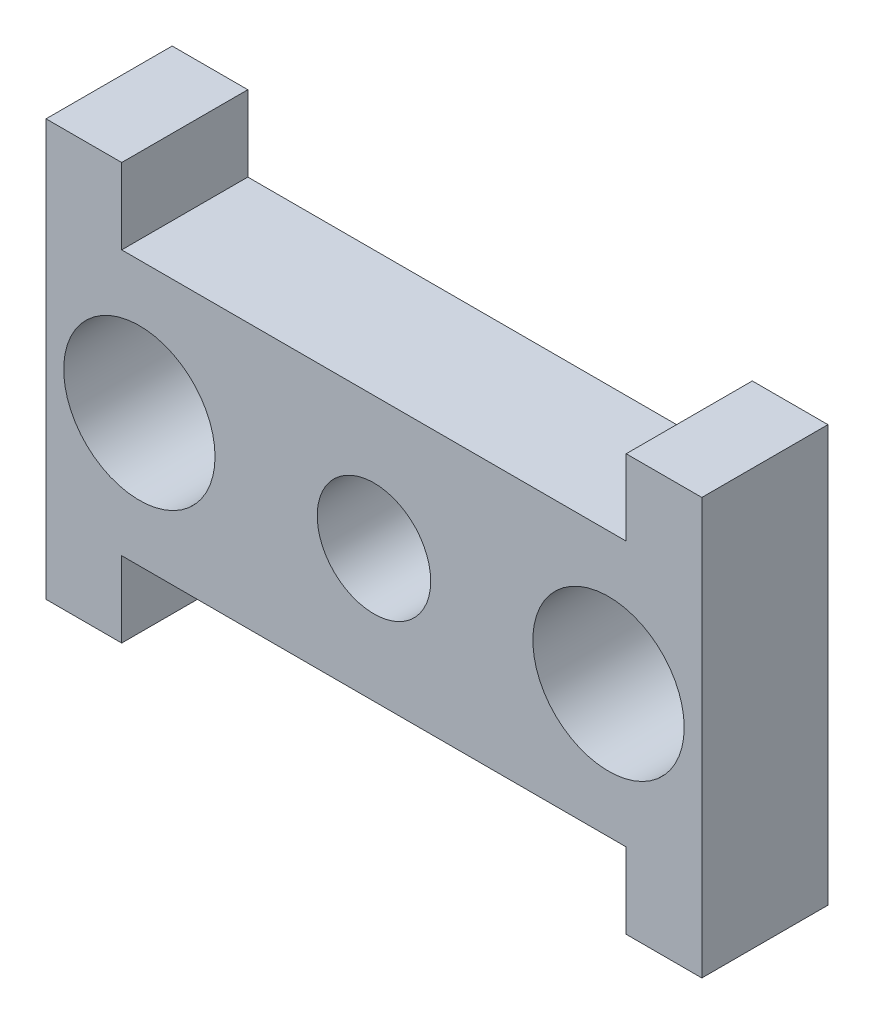
ISO-10303-21;
HEADER;
FILE_DESCRIPTION(('STEP AP214'),'2;1');
FILE_NAME('part.step','',(''),(''),'','','');
FILE_SCHEMA(('AUTOMOTIVE_DESIGN { 1 0 10303 214 1 1 1 1 }'));
ENDSEC;
DATA;
#1=APPLICATION_CONTEXT('core data for automotive mechanical design processes');
#2=APPLICATION_PROTOCOL_DEFINITION('international standard','automotive_design',2000,#1);
#3=PRODUCT_CONTEXT('',#1,'mechanical');
#4=PRODUCT('Part','Part','',(#3));
#5=PRODUCT_RELATED_PRODUCT_CATEGORY('part','',(#4));
#6=PRODUCT_DEFINITION_FORMATION('','',#4);
#7=PRODUCT_DEFINITION_CONTEXT('part definition',#1,'design');
#8=PRODUCT_DEFINITION('design','',#6,#7);
#9=PRODUCT_DEFINITION_SHAPE('','',#8);
#10=(LENGTH_UNIT() NAMED_UNIT(*) SI_UNIT(.MILLI.,.METRE.));
#11=(NAMED_UNIT(*) PLANE_ANGLE_UNIT() SI_UNIT($,.RADIAN.));
#12=(NAMED_UNIT(*) SI_UNIT($,.STERADIAN.) SOLID_ANGLE_UNIT());
#13=UNCERTAINTY_MEASURE_WITH_UNIT(LENGTH_MEASURE(1.E-05),#10,'distance_accuracy_value','');
#14=(GEOMETRIC_REPRESENTATION_CONTEXT(3) GLOBAL_UNCERTAINTY_ASSIGNED_CONTEXT((#13)) GLOBAL_UNIT_ASSIGNED_CONTEXT((#10,
#11,#12)) REPRESENTATION_CONTEXT('',''));
#15=CARTESIAN_POINT('',(0.,0.,0.));
#16=DIRECTION('',(0.,0.,1.));
#17=DIRECTION('',(1.,0.,0.));
#18=AXIS2_PLACEMENT_3D('',#15,#16,#17);
#19=CARTESIAN_POINT('',(-9.99999999999999,0.,5.));
#20=DIRECTION('',(-1.,0.,0.));
#21=DIRECTION('',(0.,-1.,0.));
#22=AXIS2_PLACEMENT_3D('',#19,#20,#21);
#23=PLANE('',#22);
#24=DIRECTION('',(0.,1.,0.));
#25=VECTOR('',#24,1.);
#26=CARTESIAN_POINT('',(-9.99999999999999,0.,0.));
#27=LINE('',#26,#25);
#28=CARTESIAN_POINT('',(-10.,-8.25000000000001,0.));
#29=VERTEX_POINT('',#28);
#30=CARTESIAN_POINT('',(-10.,-5.25,0.));
#31=VERTEX_POINT('',#30);
#32=EDGE_CURVE('E167',#29,#31,#27,.T.);
#33=ORIENTED_EDGE('',*,*,#32,.T.);
#34=DIRECTION('',(0.,0.,-1.));
#35=VECTOR('',#34,1.);
#36=CARTESIAN_POINT('',(-10.,-5.25,5.));
#37=LINE('',#36,#35);
#38=CARTESIAN_POINT('',(-10.,-5.25,5.));
#39=VERTEX_POINT('',#38);
#40=EDGE_CURVE('E11',#39,#31,#37,.T.);
#41=ORIENTED_EDGE('',*,*,#40,.F.);
#42=DIRECTION('',(0.,1.,0.));
#43=VECTOR('',#42,1.);
#44=CARTESIAN_POINT('',(-9.99999999999999,0.,5.));
#45=LINE('',#44,#43);
#46=CARTESIAN_POINT('',(-10.,-8.25000000000001,5.));
#47=VERTEX_POINT('',#46);
#48=EDGE_CURVE('E202',#47,#39,#45,.T.);
#49=ORIENTED_EDGE('',*,*,#48,.F.);
#50=DIRECTION('',(0.,0.,-1.));
#51=VECTOR('',#50,1.);
#52=CARTESIAN_POINT('',(-10.,-8.25000000000001,5.));
#53=LINE('',#52,#51);
#54=EDGE_CURVE('E166',#47,#29,#53,.T.);
#55=ORIENTED_EDGE('',*,*,#54,.T.);
#56=EDGE_LOOP('',(#33,#41,#49,#55));
#57=FACE_BOUND('',#56,.T.);
#58=ADVANCED_FACE('F35',(#57),#23,.F.);
#59=CARTESIAN_POINT('',(0.,-5.25,5.));
#60=DIRECTION('',(0.,1.,0.));
#61=DIRECTION('',(-1.,0.,0.));
#62=AXIS2_PLACEMENT_3D('',#59,#60,#61);
#63=PLANE('',#62);
#64=DIRECTION('',(1.,0.,0.));
#65=VECTOR('',#64,1.);
#66=CARTESIAN_POINT('',(0.,-5.25,0.));
#67=LINE('',#66,#65);
#68=CARTESIAN_POINT('',(10.,-5.25,0.));
#69=VERTEX_POINT('',#68);
#70=EDGE_CURVE('E170',#31,#69,#67,.T.);
#71=ORIENTED_EDGE('',*,*,#70,.T.);
#72=DIRECTION('',(0.,0.,-1.));
#73=VECTOR('',#72,1.);
#74=CARTESIAN_POINT('',(10.,-5.25,5.));
#75=LINE('',#74,#73);
#76=CARTESIAN_POINT('',(10.,-5.25,5.));
#77=VERTEX_POINT('',#76);
#78=EDGE_CURVE('E43',#77,#69,#75,.T.);
#79=ORIENTED_EDGE('',*,*,#78,.F.);
#80=DIRECTION('',(1.,0.,0.));
#81=VECTOR('',#80,1.);
#82=CARTESIAN_POINT('',(0.,-5.25,5.));
#83=LINE('',#82,#81);
#84=EDGE_CURVE('E102',#39,#77,#83,.T.);
#85=ORIENTED_EDGE('',*,*,#84,.F.);
#86=ORIENTED_EDGE('',*,*,#40,.T.);
#87=EDGE_LOOP('',(#71,#79,#85,#86));
#88=FACE_BOUND('',#87,.T.);
#89=ADVANCED_FACE('F275',(#88),#63,.F.);
#90=CARTESIAN_POINT('',(9.99999999999999,0.,5.));
#91=DIRECTION('',(1.,0.,0.));
#92=DIRECTION('',(0.,1.,0.));
#93=AXIS2_PLACEMENT_3D('',#90,#91,#92);
#94=PLANE('',#93);
#95=DIRECTION('',(0.,-1.,0.));
#96=VECTOR('',#95,1.);
#97=CARTESIAN_POINT('',(9.99999999999999,0.,0.));
#98=LINE('',#97,#96);
#99=CARTESIAN_POINT('',(10.,-8.25000000000001,0.));
#100=VERTEX_POINT('',#99);
#101=EDGE_CURVE('E172',#69,#100,#98,.T.);
#102=ORIENTED_EDGE('',*,*,#101,.T.);
#103=DIRECTION('',(0.,0.,-1.));
#104=VECTOR('',#103,1.);
#105=CARTESIAN_POINT('',(10.,-8.25000000000001,5.));
#106=LINE('',#105,#104);
#107=CARTESIAN_POINT('',(10.,-8.25000000000001,5.));
#108=VERTEX_POINT('',#107);
#109=EDGE_CURVE('E217',#108,#100,#106,.T.);
#110=ORIENTED_EDGE('',*,*,#109,.F.);
#111=DIRECTION('',(0.,-1.,0.));
#112=VECTOR('',#111,1.);
#113=CARTESIAN_POINT('',(9.99999999999999,0.,5.));
#114=LINE('',#113,#112);
#115=EDGE_CURVE('E225',#77,#108,#114,.T.);
#116=ORIENTED_EDGE('',*,*,#115,.F.);
#117=ORIENTED_EDGE('',*,*,#78,.T.);
#118=EDGE_LOOP('',(#102,#110,#116,#117));
#119=FACE_BOUND('',#118,.T.);
#120=ADVANCED_FACE('F223',(#119),#94,.F.);
#121=CARTESIAN_POINT('',(0.,-8.25000000000001,5.));
#122=DIRECTION('',(0.,1.,0.));
#123=DIRECTION('',(-1.,0.,0.));
#124=AXIS2_PLACEMENT_3D('',#121,#122,#123);
#125=PLANE('',#124);
#126=DIRECTION('',(1.,0.,0.));
#127=VECTOR('',#126,1.);
#128=CARTESIAN_POINT('',(0.,-8.25000000000001,0.));
#129=LINE('',#128,#127);
#130=CARTESIAN_POINT('',(13.,-8.25000000000001,0.));
#131=VERTEX_POINT('',#130);
#132=EDGE_CURVE('E174',#100,#131,#129,.T.);
#133=ORIENTED_EDGE('',*,*,#132,.T.);
#134=DIRECTION('',(0.,0.,-1.));
#135=VECTOR('',#134,1.);
#136=CARTESIAN_POINT('',(13.,-8.25000000000001,5.));
#137=LINE('',#136,#135);
#138=CARTESIAN_POINT('',(13.,-8.25000000000001,5.));
#139=VERTEX_POINT('',#138);
#140=EDGE_CURVE('E214',#139,#131,#137,.T.);
#141=ORIENTED_EDGE('',*,*,#140,.F.);
#142=DIRECTION('',(1.,0.,0.));
#143=VECTOR('',#142,1.);
#144=CARTESIAN_POINT('',(0.,-8.25000000000001,5.));
#145=LINE('',#144,#143);
#146=EDGE_CURVE('E154',#108,#139,#145,.T.);
#147=ORIENTED_EDGE('',*,*,#146,.F.);
#148=ORIENTED_EDGE('',*,*,#109,.T.);
#149=EDGE_LOOP('',(#133,#141,#147,#148));
#150=FACE_BOUND('',#149,.T.);
#151=ADVANCED_FACE('F234',(#150),#125,.F.);
#152=CARTESIAN_POINT('',(13.,0.,5.));
#153=DIRECTION('',(-1.,0.,0.));
#154=DIRECTION('',(0.,-1.,0.));
#155=AXIS2_PLACEMENT_3D('',#152,#153,#154);
#156=PLANE('',#155);
#157=DIRECTION('',(0.,1.,0.));
#158=VECTOR('',#157,1.);
#159=CARTESIAN_POINT('',(13.,0.,0.));
#160=LINE('',#159,#158);
#161=CARTESIAN_POINT('',(13.,8.25000000000001,0.));
#162=VERTEX_POINT('',#161);
#163=EDGE_CURVE('E176',#131,#162,#160,.T.);
#164=ORIENTED_EDGE('',*,*,#163,.T.);
#165=DIRECTION('',(0.,0.,-1.));
#166=VECTOR('',#165,1.);
#167=CARTESIAN_POINT('',(13.,8.25000000000001,5.));
#168=LINE('',#167,#166);
#169=CARTESIAN_POINT('',(13.,8.25000000000001,5.));
#170=VERTEX_POINT('',#169);
#171=EDGE_CURVE('E212',#170,#162,#168,.T.);
#172=ORIENTED_EDGE('',*,*,#171,.F.);
#173=DIRECTION('',(0.,1.,0.));
#174=VECTOR('',#173,1.);
#175=CARTESIAN_POINT('',(13.,0.,5.));
#176=LINE('',#175,#174);
#177=EDGE_CURVE('E240',#139,#170,#176,.T.);
#178=ORIENTED_EDGE('',*,*,#177,.F.);
#179=ORIENTED_EDGE('',*,*,#140,.T.);
#180=EDGE_LOOP('',(#164,#172,#178,#179));
#181=FACE_BOUND('',#180,.T.);
#182=ADVANCED_FACE('F238',(#181),#156,.F.);
#183=CARTESIAN_POINT('',(0.,8.25000000000001,5.));
#184=DIRECTION('',(0.,1.,0.));
#185=DIRECTION('',(-1.,0.,0.));
#186=AXIS2_PLACEMENT_3D('',#183,#184,#185);
#187=PLANE('',#186);
#188=DIRECTION('',(1.,0.,0.));
#189=VECTOR('',#188,1.);
#190=CARTESIAN_POINT('',(0.,8.25000000000001,0.));
#191=LINE('',#190,#189);
#192=CARTESIAN_POINT('',(10.,8.25000000000001,0.));
#193=VERTEX_POINT('',#192);
#194=EDGE_CURVE('E179',#193,#162,#191,.T.);
#195=ORIENTED_EDGE('',*,*,#194,.F.);
#196=DIRECTION('',(0.,0.,-1.));
#197=VECTOR('',#196,1.);
#198=CARTESIAN_POINT('',(10.,8.25000000000001,5.));
#199=LINE('',#198,#197);
#200=CARTESIAN_POINT('',(10.,8.25000000000001,5.));
#201=VERTEX_POINT('',#200);
#202=EDGE_CURVE('E210',#201,#193,#199,.T.);
#203=ORIENTED_EDGE('',*,*,#202,.F.);
#204=DIRECTION('',(1.,0.,0.));
#205=VECTOR('',#204,1.);
#206=CARTESIAN_POINT('',(0.,8.25000000000001,5.));
#207=LINE('',#206,#205);
#208=EDGE_CURVE('E149',#201,#170,#207,.T.);
#209=ORIENTED_EDGE('',*,*,#208,.T.);
#210=ORIENTED_EDGE('',*,*,#171,.T.);
#211=EDGE_LOOP('',(#195,#203,#209,#210));
#212=FACE_BOUND('',#211,.T.);
#213=ADVANCED_FACE('F286',(#212),#187,.T.);
#214=CARTESIAN_POINT('',(10.,0.,5.));
#215=DIRECTION('',(-1.,0.,0.));
#216=DIRECTION('',(0.,0.,1.));
#217=AXIS2_PLACEMENT_3D('',#214,#215,#216);
#218=PLANE('',#217);
#219=DIRECTION('',(0.,1.,0.));
#220=VECTOR('',#219,1.);
#221=CARTESIAN_POINT('',(10.,0.,0.));
#222=LINE('',#221,#220);
#223=CARTESIAN_POINT('',(10.,5.25,0.));
#224=VERTEX_POINT('',#223);
#225=EDGE_CURVE('E182',#224,#193,#222,.T.);
#226=ORIENTED_EDGE('',*,*,#225,.F.);
#227=DIRECTION('',(0.,0.,-1.));
#228=VECTOR('',#227,1.);
#229=CARTESIAN_POINT('',(10.,5.25,5.));
#230=LINE('',#229,#228);
#231=CARTESIAN_POINT('',(10.,5.25,5.));
#232=VERTEX_POINT('',#231);
#233=EDGE_CURVE('E208',#232,#224,#230,.T.);
#234=ORIENTED_EDGE('',*,*,#233,.F.);
#235=DIRECTION('',(0.,1.,0.));
#236=VECTOR('',#235,1.);
#237=CARTESIAN_POINT('',(10.,0.,5.));
#238=LINE('',#237,#236);
#239=EDGE_CURVE('E244',#232,#201,#238,.T.);
#240=ORIENTED_EDGE('',*,*,#239,.T.);
#241=ORIENTED_EDGE('',*,*,#202,.T.);
#242=EDGE_LOOP('',(#226,#234,#240,#241));
#243=FACE_BOUND('',#242,.T.);
#244=ADVANCED_FACE('F287',(#243),#218,.T.);
#245=CARTESIAN_POINT('',(0.,5.25,5.));
#246=DIRECTION('',(0.,1.,0.));
#247=DIRECTION('',(-1.,0.,0.));
#248=AXIS2_PLACEMENT_3D('',#245,#246,#247);
#249=PLANE('',#248);
#250=DIRECTION('',(1.,0.,0.));
#251=VECTOR('',#250,1.);
#252=CARTESIAN_POINT('',(0.,5.25,0.));
#253=LINE('',#252,#251);
#254=CARTESIAN_POINT('',(-10.,5.25,0.));
#255=VERTEX_POINT('',#254);
#256=EDGE_CURVE('E185',#255,#224,#253,.T.);
#257=ORIENTED_EDGE('',*,*,#256,.F.);
#258=DIRECTION('',(0.,0.,-1.));
#259=VECTOR('',#258,1.);
#260=CARTESIAN_POINT('',(-10.,5.25,5.));
#261=LINE('',#260,#259);
#262=CARTESIAN_POINT('',(-10.,5.25,5.));
#263=VERTEX_POINT('',#262);
#264=EDGE_CURVE('E206',#263,#255,#261,.T.);
#265=ORIENTED_EDGE('',*,*,#264,.F.);
#266=DIRECTION('',(1.,0.,0.));
#267=VECTOR('',#266,1.);
#268=CARTESIAN_POINT('',(0.,5.25,5.));
#269=LINE('',#268,#267);
#270=EDGE_CURVE('E248',#263,#232,#269,.T.);
#271=ORIENTED_EDGE('',*,*,#270,.T.);
#272=ORIENTED_EDGE('',*,*,#233,.T.);
#273=EDGE_LOOP('',(#257,#265,#271,#272));
#274=FACE_BOUND('',#273,.T.);
#275=ADVANCED_FACE('F290',(#274),#249,.T.);
#276=CARTESIAN_POINT('',(-9.99999999999999,0.,5.));
#277=DIRECTION('',(1.,0.,0.));
#278=DIRECTION('',(0.,1.,0.));
#279=AXIS2_PLACEMENT_3D('',#276,#277,#278);
#280=PLANE('',#279);
#281=DIRECTION('',(0.,-1.,0.));
#282=VECTOR('',#281,1.);
#283=CARTESIAN_POINT('',(-9.99999999999999,0.,0.));
#284=LINE('',#283,#282);
#285=CARTESIAN_POINT('',(-10.,8.25,0.));
#286=VERTEX_POINT('',#285);
#287=EDGE_CURVE('E188',#286,#255,#284,.T.);
#288=ORIENTED_EDGE('',*,*,#287,.F.);
#289=DIRECTION('',(0.,0.,-1.));
#290=VECTOR('',#289,1.);
#291=CARTESIAN_POINT('',(-10.,8.25,5.));
#292=LINE('',#291,#290);
#293=CARTESIAN_POINT('',(-10.,8.25,5.));
#294=VERTEX_POINT('',#293);
#295=EDGE_CURVE('E139',#294,#286,#292,.T.);
#296=ORIENTED_EDGE('',*,*,#295,.F.);
#297=DIRECTION('',(0.,-1.,0.));
#298=VECTOR('',#297,1.);
#299=CARTESIAN_POINT('',(-9.99999999999999,0.,5.));
#300=LINE('',#299,#298);
#301=EDGE_CURVE('E147',#294,#263,#300,.T.);
#302=ORIENTED_EDGE('',*,*,#301,.T.);
#303=ORIENTED_EDGE('',*,*,#264,.T.);
#304=EDGE_LOOP('',(#288,#296,#302,#303));
#305=FACE_BOUND('',#304,.T.);
#306=ADVANCED_FACE('F253',(#305),#280,.T.);
#307=CARTESIAN_POINT('',(-13.,8.25,0.));
#308=VERTEX_POINT('',#307);
#309=EDGE_CURVE('E134',#308,#286,#191,.T.);
#310=ORIENTED_EDGE('',*,*,#309,.F.);
#311=DIRECTION('',(0.,0.,-1.));
#312=VECTOR('',#311,1.);
#313=CARTESIAN_POINT('',(-13.,8.25,5.));
#314=LINE('',#313,#312);
#315=CARTESIAN_POINT('',(-13.,8.25,5.));
#316=VERTEX_POINT('',#315);
#317=EDGE_CURVE('E129',#316,#308,#314,.T.);
#318=ORIENTED_EDGE('',*,*,#317,.F.);
#319=EDGE_CURVE('E132',#316,#294,#207,.T.);
#320=ORIENTED_EDGE('',*,*,#319,.T.);
#321=ORIENTED_EDGE('',*,*,#295,.T.);
#322=EDGE_LOOP('',(#310,#318,#320,#321));
#323=FACE_BOUND('',#322,.T.);
#324=ADVANCED_FACE('F131',(#323),#187,.T.);
#325=CARTESIAN_POINT('',(-13.,0.,5.));
#326=DIRECTION('',(-1.,0.,0.));
#327=DIRECTION('',(0.,0.,1.));
#328=AXIS2_PLACEMENT_3D('',#325,#326,#327);
#329=PLANE('',#328);
#330=DIRECTION('',(0.,1.,0.));
#331=VECTOR('',#330,1.);
#332=CARTESIAN_POINT('',(-13.,0.,0.));
#333=LINE('',#332,#331);
#334=CARTESIAN_POINT('',(-13.,-8.25000000000001,0.));
#335=VERTEX_POINT('',#334);
#336=EDGE_CURVE('E191',#335,#308,#333,.T.);
#337=ORIENTED_EDGE('',*,*,#336,.F.);
#338=DIRECTION('',(0.,0.,-1.));
#339=VECTOR('',#338,1.);
#340=CARTESIAN_POINT('',(-13.,-8.25000000000001,5.));
#341=LINE('',#340,#339);
#342=CARTESIAN_POINT('',(-13.,-8.25000000000001,5.));
#343=VERTEX_POINT('',#342);
#344=EDGE_CURVE('E91',#343,#335,#341,.T.);
#345=ORIENTED_EDGE('',*,*,#344,.F.);
#346=DIRECTION('',(0.,1.,0.));
#347=VECTOR('',#346,1.);
#348=CARTESIAN_POINT('',(-13.,0.,5.));
#349=LINE('',#348,#347);
#350=EDGE_CURVE('E144',#343,#316,#349,.T.);
#351=ORIENTED_EDGE('',*,*,#350,.T.);
#352=ORIENTED_EDGE('',*,*,#317,.T.);
#353=EDGE_LOOP('',(#337,#345,#351,#352));
#354=FACE_BOUND('',#353,.T.);
#355=ADVANCED_FACE('F150',(#354),#329,.T.);
#356=CARTESIAN_POINT('',(9.3,0.,5.));
#357=DIRECTION('',(0.,0.,-1.));
#358=DIRECTION('',(-1.,0.,0.));
#359=AXIS2_PLACEMENT_3D('',#356,#357,#358);
#360=CYLINDRICAL_SURFACE('',#359,3.);
#361=CARTESIAN_POINT('',(9.3,0.,5.));
#362=DIRECTION('',(0.,0.,1.));
#363=DIRECTION('',(1.,0.,0.));
#364=AXIS2_PLACEMENT_3D('',#361,#362,#363);
#365=CIRCLE('',#364,3.);
#366=CARTESIAN_POINT('',(12.3,0.,5.));
#367=VERTEX_POINT('',#366);
#368=EDGE_CURVE('E160',#367,#367,#365,.T.);
#369=ORIENTED_EDGE('',*,*,#368,.T.);
#370=EDGE_LOOP('',(#369));
#371=FACE_BOUND('',#370,.T.);
#372=CARTESIAN_POINT('',(9.3,0.,0.));
#373=DIRECTION('',(0.,0.,1.));
#374=DIRECTION('',(1.,0.,0.));
#375=AXIS2_PLACEMENT_3D('',#372,#373,#374);
#376=CIRCLE('',#375,3.);
#377=CARTESIAN_POINT('',(12.3,0.,0.));
#378=VERTEX_POINT('',#377);
#379=EDGE_CURVE('E196',#378,#378,#376,.T.);
#380=ORIENTED_EDGE('',*,*,#379,.F.);
#381=EDGE_LOOP('',(#380));
#382=FACE_BOUND('',#381,.T.);
#383=ADVANCED_FACE('F269',(#371,#382),#360,.F.);
#384=CARTESIAN_POINT('',(0.,0.,5.));
#385=DIRECTION('',(0.,0.,-1.));
#386=DIRECTION('',(-1.,0.,0.));
#387=AXIS2_PLACEMENT_3D('',#384,#385,#386);
#388=CYLINDRICAL_SURFACE('',#387,2.25);
#389=CARTESIAN_POINT('',(0.,0.,5.));
#390=DIRECTION('',(0.,0.,1.));
#391=DIRECTION('',(1.,0.,0.));
#392=AXIS2_PLACEMENT_3D('',#389,#390,#391);
#393=CIRCLE('',#392,2.25);
#394=CARTESIAN_POINT('',(2.25,0.,5.));
#395=VERTEX_POINT('',#394);
#396=EDGE_CURVE('E152',#395,#395,#393,.T.);
#397=ORIENTED_EDGE('',*,*,#396,.T.);
#398=EDGE_LOOP('',(#397));
#399=FACE_BOUND('',#398,.T.);
#400=CARTESIAN_POINT('',(0.,0.,0.));
#401=DIRECTION('',(0.,0.,1.));
#402=DIRECTION('',(1.,0.,0.));
#403=AXIS2_PLACEMENT_3D('',#400,#401,#402);
#404=CIRCLE('',#403,2.25);
#405=CARTESIAN_POINT('',(2.25,0.,0.));
#406=VERTEX_POINT('',#405);
#407=EDGE_CURVE('E193',#406,#406,#404,.T.);
#408=ORIENTED_EDGE('',*,*,#407,.F.);
#409=EDGE_LOOP('',(#408));
#410=FACE_BOUND('',#409,.T.);
#411=ADVANCED_FACE('F261',(#399,#410),#388,.F.);
#412=EDGE_CURVE('E94',#335,#29,#129,.T.);
#413=ORIENTED_EDGE('',*,*,#412,.T.);
#414=ORIENTED_EDGE('',*,*,#54,.F.);
#415=EDGE_CURVE('E51',#343,#47,#145,.T.);
#416=ORIENTED_EDGE('',*,*,#415,.F.);
#417=ORIENTED_EDGE('',*,*,#344,.T.);
#418=EDGE_LOOP('',(#413,#414,#416,#417));
#419=FACE_BOUND('',#418,.T.);
#420=ADVANCED_FACE('F258',(#419),#125,.F.);
#421=CARTESIAN_POINT('',(-9.3,-1.0325074129014E-13,5.));
#422=DIRECTION('',(0.,0.,-1.));
#423=DIRECTION('',(-1.,0.,0.));
#424=AXIS2_PLACEMENT_3D('',#421,#422,#423);
#425=CYLINDRICAL_SURFACE('',#424,3.);
#426=CARTESIAN_POINT('',(-9.3,-1.0325074129014E-13,5.));
#427=DIRECTION('',(0.,0.,1.));
#428=DIRECTION('',(1.,0.,0.));
#429=AXIS2_PLACEMENT_3D('',#426,#427,#428);
#430=CIRCLE('',#429,3.);
#431=CARTESIAN_POINT('',(-6.3,-1.0325074129014E-13,5.));
#432=VERTEX_POINT('',#431);
#433=EDGE_CURVE('E163',#432,#432,#430,.F.);
#434=ORIENTED_EDGE('',*,*,#433,.F.);
#435=EDGE_LOOP('',(#434));
#436=FACE_BOUND('',#435,.T.);
#437=CARTESIAN_POINT('',(-9.3,-1.0325074129014E-13,0.));
#438=DIRECTION('',(0.,0.,1.));
#439=DIRECTION('',(1.,0.,0.));
#440=AXIS2_PLACEMENT_3D('',#437,#438,#439);
#441=CIRCLE('',#440,3.);
#442=CARTESIAN_POINT('',(-6.3,-1.0325074129014E-13,0.));
#443=VERTEX_POINT('',#442);
#444=EDGE_CURVE('E199',#443,#443,#441,.F.);
#445=ORIENTED_EDGE('',*,*,#444,.T.);
#446=EDGE_LOOP('',(#445));
#447=FACE_BOUND('',#446,.T.);
#448=ADVANCED_FACE('F260',(#436,#447),#425,.F.);
#449=CARTESIAN_POINT('',(0.,0.,5.));
#450=DIRECTION('',(0.,0.,1.));
#451=DIRECTION('',(1.,0.,0.));
#452=AXIS2_PLACEMENT_3D('',#449,#450,#451);
#453=PLANE('',#452);
#454=ORIENTED_EDGE('',*,*,#48,.T.);
#455=ORIENTED_EDGE('',*,*,#84,.T.);
#456=ORIENTED_EDGE('',*,*,#115,.T.);
#457=ORIENTED_EDGE('',*,*,#146,.T.);
#458=ORIENTED_EDGE('',*,*,#177,.T.);
#459=ORIENTED_EDGE('',*,*,#208,.F.);
#460=ORIENTED_EDGE('',*,*,#239,.F.);
#461=ORIENTED_EDGE('',*,*,#270,.F.);
#462=ORIENTED_EDGE('',*,*,#301,.F.);
#463=ORIENTED_EDGE('',*,*,#319,.F.);
#464=ORIENTED_EDGE('',*,*,#350,.F.);
#465=ORIENTED_EDGE('',*,*,#415,.T.);
#466=EDGE_LOOP('',(#454,#455,#456,#457,#458,#459,#460,#461,#462,#463,#464,#465));
#467=FACE_BOUND('',#466,.T.);
#468=ORIENTED_EDGE('',*,*,#396,.F.);
#469=EDGE_LOOP('',(#468));
#470=FACE_BOUND('',#469,.T.);
#471=ORIENTED_EDGE('',*,*,#368,.F.);
#472=EDGE_LOOP('',(#471));
#473=FACE_BOUND('',#472,.T.);
#474=ORIENTED_EDGE('',*,*,#433,.T.);
#475=EDGE_LOOP('',(#474));
#476=FACE_BOUND('',#475,.T.);
#477=ADVANCED_FACE('F142',(#467,#470,#473,#476),#453,.T.);
#478=CARTESIAN_POINT('',(0.,0.,0.));
#479=DIRECTION('',(0.,0.,1.));
#480=DIRECTION('',(1.,0.,0.));
#481=AXIS2_PLACEMENT_3D('',#478,#479,#480);
#482=PLANE('',#481);
#483=ORIENTED_EDGE('',*,*,#32,.F.);
#484=ORIENTED_EDGE('',*,*,#412,.F.);
#485=ORIENTED_EDGE('',*,*,#336,.T.);
#486=ORIENTED_EDGE('',*,*,#309,.T.);
#487=ORIENTED_EDGE('',*,*,#287,.T.);
#488=ORIENTED_EDGE('',*,*,#256,.T.);
#489=ORIENTED_EDGE('',*,*,#225,.T.);
#490=ORIENTED_EDGE('',*,*,#194,.T.);
#491=ORIENTED_EDGE('',*,*,#163,.F.);
#492=ORIENTED_EDGE('',*,*,#132,.F.);
#493=ORIENTED_EDGE('',*,*,#101,.F.);
#494=ORIENTED_EDGE('',*,*,#70,.F.);
#495=EDGE_LOOP('',(#483,#484,#485,#486,#487,#488,#489,#490,#491,#492,#493,#494));
#496=FACE_BOUND('',#495,.T.);
#497=ORIENTED_EDGE('',*,*,#407,.T.);
#498=EDGE_LOOP('',(#497));
#499=FACE_BOUND('',#498,.T.);
#500=ORIENTED_EDGE('',*,*,#379,.T.);
#501=EDGE_LOOP('',(#500));
#502=FACE_BOUND('',#501,.T.);
#503=ORIENTED_EDGE('',*,*,#444,.F.);
#504=EDGE_LOOP('',(#503));
#505=FACE_BOUND('',#504,.T.);
#506=ADVANCED_FACE('F229',(#496,#499,#502,#505),#482,.F.);
#507=CLOSED_SHELL('',(#58,#89,#120,#151,#182,#213,#244,#275,#306,#324,#355,#383,#411,#420,#448,
#477,#506));
#508=MANIFOLD_SOLID_BREP('B2',#507);
#509=ADVANCED_BREP_SHAPE_REPRESENTATION('',(#18,#508),#14);
#510=SHAPE_DEFINITION_REPRESENTATION(#9,#509);
ENDSEC;
END-ISO-10303-21;
